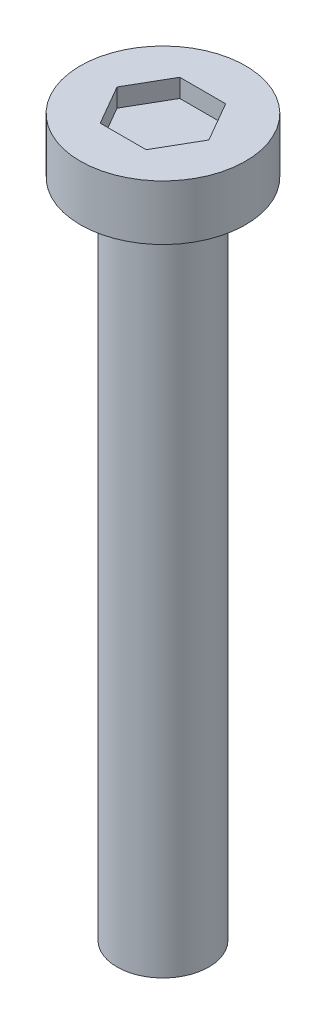
ISO-10303-21;
HEADER;
FILE_DESCRIPTION(('STEP AP214'),'2;1');
FILE_NAME('part.step','',(''),(''),'','','');
FILE_SCHEMA(('AUTOMOTIVE_DESIGN { 1 0 10303 214 1 1 1 1 }'));
ENDSEC;
DATA;
#1=APPLICATION_CONTEXT('core data for automotive mechanical design processes');
#2=APPLICATION_PROTOCOL_DEFINITION('international standard','automotive_design',2000,#1);
#3=PRODUCT_CONTEXT('',#1,'mechanical');
#4=PRODUCT('Part','Part','',(#3));
#5=PRODUCT_RELATED_PRODUCT_CATEGORY('part','',(#4));
#6=PRODUCT_DEFINITION_FORMATION('','',#4);
#7=PRODUCT_DEFINITION_CONTEXT('part definition',#1,'design');
#8=PRODUCT_DEFINITION('design','',#6,#7);
#9=PRODUCT_DEFINITION_SHAPE('','',#8);
#10=(LENGTH_UNIT() NAMED_UNIT(*) SI_UNIT(.MILLI.,.METRE.));
#11=(NAMED_UNIT(*) PLANE_ANGLE_UNIT() SI_UNIT($,.RADIAN.));
#12=(NAMED_UNIT(*) SI_UNIT($,.STERADIAN.) SOLID_ANGLE_UNIT());
#13=UNCERTAINTY_MEASURE_WITH_UNIT(LENGTH_MEASURE(1.E-05),#10,'distance_accuracy_value','');
#14=(GEOMETRIC_REPRESENTATION_CONTEXT(3) GLOBAL_UNCERTAINTY_ASSIGNED_CONTEXT((#13)) GLOBAL_UNIT_ASSIGNED_CONTEXT((#10,
#11,#12)) REPRESENTATION_CONTEXT('',''));
#15=CARTESIAN_POINT('',(0.,0.,0.));
#16=DIRECTION('',(0.,0.,1.));
#17=DIRECTION('',(1.,0.,0.));
#18=AXIS2_PLACEMENT_3D('',#15,#16,#17);
#19=CARTESIAN_POINT('',(0.,18.,0.));
#20=DIRECTION('',(0.,-1.,0.));
#21=DIRECTION('',(0.,0.,-1.));
#22=AXIS2_PLACEMENT_3D('',#19,#20,#21);
#23=CYLINDRICAL_SURFACE('',#22,1.25);
#24=CARTESIAN_POINT('',(0.,18.,0.));
#25=DIRECTION('',(0.,1.,0.));
#26=DIRECTION('',(0.,0.,1.));
#27=AXIS2_PLACEMENT_3D('',#24,#25,#26);
#28=CIRCLE('',#27,1.25);
#29=CARTESIAN_POINT('',(0.,18.,1.25));
#30=VERTEX_POINT('',#29);
#31=EDGE_CURVE('E11',#30,#30,#28,.T.);
#32=ORIENTED_EDGE('',*,*,#31,.F.);
#33=EDGE_LOOP('',(#32));
#34=FACE_BOUND('',#33,.T.);
#35=CARTESIAN_POINT('',(0.,0.,0.));
#36=DIRECTION('',(0.,1.,0.));
#37=DIRECTION('',(0.,0.,1.));
#38=AXIS2_PLACEMENT_3D('',#35,#36,#37);
#39=CIRCLE('',#38,1.25);
#40=CARTESIAN_POINT('',(0.,0.,1.25));
#41=VERTEX_POINT('',#40);
#42=EDGE_CURVE('E42',#41,#41,#39,.T.);
#43=ORIENTED_EDGE('',*,*,#42,.T.);
#44=EDGE_LOOP('',(#43));
#45=FACE_BOUND('',#44,.T.);
#46=ADVANCED_FACE('F39',(#34,#45),#23,.T.);
#47=CARTESIAN_POINT('',(0.,0.,0.));
#48=DIRECTION('',(0.,1.,0.));
#49=DIRECTION('',(0.,0.,1.));
#50=AXIS2_PLACEMENT_3D('',#47,#48,#49);
#51=PLANE('',#50);
#52=ORIENTED_EDGE('',*,*,#42,.F.);
#53=EDGE_LOOP('',(#52));
#54=FACE_BOUND('',#53,.T.);
#55=ADVANCED_FACE('F189',(#54),#51,.F.);
#56=CARTESIAN_POINT('',(0.,19.5,0.));
#57=DIRECTION('',(0.,-1.,0.));
#58=DIRECTION('',(0.,0.,-1.));
#59=AXIS2_PLACEMENT_3D('',#56,#57,#58);
#60=CYLINDRICAL_SURFACE('',#59,2.25);
#61=CARTESIAN_POINT('',(0.,19.5,0.));
#62=DIRECTION('',(0.,1.,0.));
#63=DIRECTION('',(0.,0.,1.));
#64=AXIS2_PLACEMENT_3D('',#61,#62,#63);
#65=CIRCLE('',#64,2.25);
#66=CARTESIAN_POINT('',(0.,19.5,2.25));
#67=VERTEX_POINT('',#66);
#68=EDGE_CURVE('E163',#67,#67,#65,.T.);
#69=ORIENTED_EDGE('',*,*,#68,.F.);
#70=EDGE_LOOP('',(#69));
#71=FACE_BOUND('',#70,.T.);
#72=CARTESIAN_POINT('',(0.,18.,0.));
#73=DIRECTION('',(0.,1.,0.));
#74=DIRECTION('',(0.,0.,1.));
#75=AXIS2_PLACEMENT_3D('',#72,#73,#74);
#76=CIRCLE('',#75,2.25);
#77=CARTESIAN_POINT('',(0.,18.,2.25));
#78=VERTEX_POINT('',#77);
#79=EDGE_CURVE('E153',#78,#78,#76,.T.);
#80=ORIENTED_EDGE('',*,*,#79,.T.);
#81=EDGE_LOOP('',(#80));
#82=FACE_BOUND('',#81,.T.);
#83=ADVANCED_FACE('F171',(#71,#82),#60,.T.);
#84=CARTESIAN_POINT('',(0.,19.5,0.));
#85=DIRECTION('',(0.,1.,0.));
#86=DIRECTION('',(0.,0.,1.));
#87=AXIS2_PLACEMENT_3D('',#84,#85,#86);
#88=PLANE('',#87);
#89=DIRECTION('',(0.5,0.,-0.866025403784439));
#90=VECTOR('',#89,1.);
#91=CARTESIAN_POINT('',(0.625,19.5,1.08253175473055));
#92=LINE('',#91,#90);
#93=CARTESIAN_POINT('',(0.625,19.5,1.08253175473055));
#94=VERTEX_POINT('',#93);
#95=CARTESIAN_POINT('',(1.25,19.5,0.));
#96=VERTEX_POINT('',#95);
#97=EDGE_CURVE('E54',#94,#96,#92,.T.);
#98=ORIENTED_EDGE('',*,*,#97,.F.);
#99=DIRECTION('',(1.,0.,0.));
#100=VECTOR('',#99,1.);
#101=CARTESIAN_POINT('',(-0.625,19.5,1.08253175473055));
#102=LINE('',#101,#100);
#103=CARTESIAN_POINT('',(-0.625,19.5,1.08253175473055));
#104=VERTEX_POINT('',#103);
#105=EDGE_CURVE('E147',#104,#94,#102,.T.);
#106=ORIENTED_EDGE('',*,*,#105,.F.);
#107=DIRECTION('',(0.5,0.,0.866025403784439));
#108=VECTOR('',#107,1.);
#109=CARTESIAN_POINT('',(-1.25,19.5,0.));
#110=LINE('',#109,#108);
#111=CARTESIAN_POINT('',(-1.25,19.5,0.));
#112=VERTEX_POINT('',#111);
#113=EDGE_CURVE('E144',#112,#104,#110,.T.);
#114=ORIENTED_EDGE('',*,*,#113,.F.);
#115=DIRECTION('',(-0.5,0.,0.866025403784439));
#116=VECTOR('',#115,1.);
#117=CARTESIAN_POINT('',(-0.625,19.5,-1.08253175473055));
#118=LINE('',#117,#116);
#119=CARTESIAN_POINT('',(-0.625,19.5,-1.08253175473055));
#120=VERTEX_POINT('',#119);
#121=EDGE_CURVE('E102',#120,#112,#118,.T.);
#122=ORIENTED_EDGE('',*,*,#121,.F.);
#123=DIRECTION('',(-1.,0.,0.));
#124=VECTOR('',#123,1.);
#125=CARTESIAN_POINT('',(0.625,19.5,-1.08253175473055));
#126=LINE('',#125,#124);
#127=CARTESIAN_POINT('',(0.625,19.5,-1.08253175473055));
#128=VERTEX_POINT('',#127);
#129=EDGE_CURVE('E138',#128,#120,#126,.T.);
#130=ORIENTED_EDGE('',*,*,#129,.F.);
#131=DIRECTION('',(-0.5,0.,-0.866025403784439));
#132=VECTOR('',#131,1.);
#133=CARTESIAN_POINT('',(1.25,19.5,0.));
#134=LINE('',#133,#132);
#135=EDGE_CURVE('E134',#96,#128,#134,.T.);
#136=ORIENTED_EDGE('',*,*,#135,.F.);
#137=EDGE_LOOP('',(#98,#106,#114,#122,#130,#136));
#138=FACE_BOUND('',#137,.T.);
#139=ORIENTED_EDGE('',*,*,#68,.T.);
#140=EDGE_LOOP('',(#139));
#141=FACE_BOUND('',#140,.T.);
#142=ADVANCED_FACE('F176',(#138,#141),#88,.T.);
#143=CARTESIAN_POINT('',(0.,18.,0.));
#144=DIRECTION('',(0.,1.,0.));
#145=DIRECTION('',(0.,0.,1.));
#146=AXIS2_PLACEMENT_3D('',#143,#144,#145);
#147=PLANE('',#146);
#148=ORIENTED_EDGE('',*,*,#31,.T.);
#149=EDGE_LOOP('',(#148));
#150=FACE_BOUND('',#149,.T.);
#151=ORIENTED_EDGE('',*,*,#79,.F.);
#152=EDGE_LOOP('',(#151));
#153=FACE_BOUND('',#152,.T.);
#154=ADVANCED_FACE('F173',(#150,#153),#147,.F.);
#155=CARTESIAN_POINT('',(0.625,19.,1.08253175473055));
#156=DIRECTION('',(0.866025403784439,0.,0.5));
#157=DIRECTION('',(0.5,0.,-0.866025403784439));
#158=AXIS2_PLACEMENT_3D('',#155,#156,#157);
#159=PLANE('',#158);
#160=ORIENTED_EDGE('',*,*,#97,.T.);
#161=DIRECTION('',(0.,1.,0.));
#162=VECTOR('',#161,1.);
#163=CARTESIAN_POINT('',(1.25,19.,0.));
#164=LINE('',#163,#162);
#165=CARTESIAN_POINT('',(1.25,19.,0.));
#166=VERTEX_POINT('',#165);
#167=EDGE_CURVE('E84',#166,#96,#164,.T.);
#168=ORIENTED_EDGE('',*,*,#167,.F.);
#169=DIRECTION('',(0.5,0.,-0.866025403784439));
#170=VECTOR('',#169,1.);
#171=CARTESIAN_POINT('',(0.625,19.,1.08253175473055));
#172=LINE('',#171,#170);
#173=CARTESIAN_POINT('',(0.625,19.,1.08253175473055));
#174=VERTEX_POINT('',#173);
#175=EDGE_CURVE('E150',#174,#166,#172,.T.);
#176=ORIENTED_EDGE('',*,*,#175,.F.);
#177=DIRECTION('',(0.,1.,0.));
#178=VECTOR('',#177,1.);
#179=CARTESIAN_POINT('',(0.625,19.,1.08253175473055));
#180=LINE('',#179,#178);
#181=EDGE_CURVE('E62',#174,#94,#180,.T.);
#182=ORIENTED_EDGE('',*,*,#181,.T.);
#183=EDGE_LOOP('',(#160,#168,#176,#182));
#184=FACE_BOUND('',#183,.T.);
#185=ADVANCED_FACE('F175',(#184),#159,.F.);
#186=CARTESIAN_POINT('',(-0.625,19.,1.08253175473055));
#187=DIRECTION('',(0.,0.,1.));
#188=DIRECTION('',(1.,0.,0.));
#189=AXIS2_PLACEMENT_3D('',#186,#187,#188);
#190=PLANE('',#189);
#191=ORIENTED_EDGE('',*,*,#105,.T.);
#192=ORIENTED_EDGE('',*,*,#181,.F.);
#193=DIRECTION('',(1.,0.,0.));
#194=VECTOR('',#193,1.);
#195=CARTESIAN_POINT('',(-0.625,19.,1.08253175473055));
#196=LINE('',#195,#194);
#197=CARTESIAN_POINT('',(-0.625,19.,1.08253175473055));
#198=VERTEX_POINT('',#197);
#199=EDGE_CURVE('E116',#198,#174,#196,.T.);
#200=ORIENTED_EDGE('',*,*,#199,.F.);
#201=DIRECTION('',(0.,1.,0.));
#202=VECTOR('',#201,1.);
#203=CARTESIAN_POINT('',(-0.625,19.,1.08253175473055));
#204=LINE('',#203,#202);
#205=EDGE_CURVE('E107',#198,#104,#204,.T.);
#206=ORIENTED_EDGE('',*,*,#205,.T.);
#207=EDGE_LOOP('',(#191,#192,#200,#206));
#208=FACE_BOUND('',#207,.T.);
#209=ADVANCED_FACE('F183',(#208),#190,.F.);
#210=CARTESIAN_POINT('',(-1.25,19.,0.));
#211=DIRECTION('',(-0.866025403784439,0.,0.5));
#212=DIRECTION('',(0.5,0.,0.866025403784439));
#213=AXIS2_PLACEMENT_3D('',#210,#211,#212);
#214=PLANE('',#213);
#215=ORIENTED_EDGE('',*,*,#113,.T.);
#216=ORIENTED_EDGE('',*,*,#205,.F.);
#217=DIRECTION('',(0.5,0.,0.866025403784439));
#218=VECTOR('',#217,1.);
#219=CARTESIAN_POINT('',(-1.25,19.,0.));
#220=LINE('',#219,#218);
#221=CARTESIAN_POINT('',(-1.25,19.,0.));
#222=VERTEX_POINT('',#221);
#223=EDGE_CURVE('E111',#222,#198,#220,.T.);
#224=ORIENTED_EDGE('',*,*,#223,.F.);
#225=DIRECTION('',(0.,1.,0.));
#226=VECTOR('',#225,1.);
#227=CARTESIAN_POINT('',(-1.25,19.,0.));
#228=LINE('',#227,#226);
#229=EDGE_CURVE('E95',#222,#112,#228,.T.);
#230=ORIENTED_EDGE('',*,*,#229,.T.);
#231=EDGE_LOOP('',(#215,#216,#224,#230));
#232=FACE_BOUND('',#231,.T.);
#233=ADVANCED_FACE('F112',(#232),#214,.F.);
#234=CARTESIAN_POINT('',(-0.625,19.,-1.08253175473055));
#235=DIRECTION('',(-0.866025403784439,0.,-0.5));
#236=DIRECTION('',(-0.5,0.,0.866025403784439));
#237=AXIS2_PLACEMENT_3D('',#234,#235,#236);
#238=PLANE('',#237);
#239=ORIENTED_EDGE('',*,*,#121,.T.);
#240=ORIENTED_EDGE('',*,*,#229,.F.);
#241=DIRECTION('',(-0.5,0.,0.866025403784439));
#242=VECTOR('',#241,1.);
#243=CARTESIAN_POINT('',(-0.625,19.,-1.08253175473055));
#244=LINE('',#243,#242);
#245=CARTESIAN_POINT('',(-0.625,19.,-1.08253175473055));
#246=VERTEX_POINT('',#245);
#247=EDGE_CURVE('E99',#246,#222,#244,.T.);
#248=ORIENTED_EDGE('',*,*,#247,.F.);
#249=DIRECTION('',(0.,1.,0.));
#250=VECTOR('',#249,1.);
#251=CARTESIAN_POINT('',(-0.625,19.,-1.08253175473055));
#252=LINE('',#251,#250);
#253=EDGE_CURVE('E108',#246,#120,#252,.T.);
#254=ORIENTED_EDGE('',*,*,#253,.T.);
#255=EDGE_LOOP('',(#239,#240,#248,#254));
#256=FACE_BOUND('',#255,.T.);
#257=ADVANCED_FACE('F97',(#256),#238,.F.);
#258=CARTESIAN_POINT('',(0.625,19.,-1.08253175473055));
#259=DIRECTION('',(0.,0.,-1.));
#260=DIRECTION('',(-1.,0.,0.));
#261=AXIS2_PLACEMENT_3D('',#258,#259,#260);
#262=PLANE('',#261);
#263=ORIENTED_EDGE('',*,*,#129,.T.);
#264=ORIENTED_EDGE('',*,*,#253,.F.);
#265=DIRECTION('',(-1.,0.,0.));
#266=VECTOR('',#265,1.);
#267=CARTESIAN_POINT('',(0.625,19.,-1.08253175473055));
#268=LINE('',#267,#266);
#269=CARTESIAN_POINT('',(0.625,19.,-1.08253175473055));
#270=VERTEX_POINT('',#269);
#271=EDGE_CURVE('E122',#270,#246,#268,.T.);
#272=ORIENTED_EDGE('',*,*,#271,.F.);
#273=DIRECTION('',(0.,1.,0.));
#274=VECTOR('',#273,1.);
#275=CARTESIAN_POINT('',(0.625,19.,-1.08253175473055));
#276=LINE('',#275,#274);
#277=EDGE_CURVE('E158',#270,#128,#276,.T.);
#278=ORIENTED_EDGE('',*,*,#277,.T.);
#279=EDGE_LOOP('',(#263,#264,#272,#278));
#280=FACE_BOUND('',#279,.T.);
#281=ADVANCED_FACE('F245',(#280),#262,.F.);
#282=CARTESIAN_POINT('',(1.25,19.,0.));
#283=DIRECTION('',(0.866025403784439,0.,-0.5));
#284=DIRECTION('',(-0.5,0.,-0.866025403784439));
#285=AXIS2_PLACEMENT_3D('',#282,#283,#284);
#286=PLANE('',#285);
#287=ORIENTED_EDGE('',*,*,#135,.T.);
#288=ORIENTED_EDGE('',*,*,#277,.F.);
#289=DIRECTION('',(-0.5,0.,-0.866025403784439));
#290=VECTOR('',#289,1.);
#291=CARTESIAN_POINT('',(1.25,19.,0.));
#292=LINE('',#291,#290);
#293=EDGE_CURVE('E126',#166,#270,#292,.T.);
#294=ORIENTED_EDGE('',*,*,#293,.F.);
#295=ORIENTED_EDGE('',*,*,#167,.T.);
#296=EDGE_LOOP('',(#287,#288,#294,#295));
#297=FACE_BOUND('',#296,.T.);
#298=ADVANCED_FACE('F254',(#297),#286,.F.);
#299=CARTESIAN_POINT('',(0.,19.,0.));
#300=DIRECTION('',(0.,1.,0.));
#301=DIRECTION('',(0.,0.,1.));
#302=AXIS2_PLACEMENT_3D('',#299,#300,#301);
#303=PLANE('',#302);
#304=ORIENTED_EDGE('',*,*,#175,.T.);
#305=ORIENTED_EDGE('',*,*,#293,.T.);
#306=ORIENTED_EDGE('',*,*,#271,.T.);
#307=ORIENTED_EDGE('',*,*,#247,.T.);
#308=ORIENTED_EDGE('',*,*,#223,.T.);
#309=ORIENTED_EDGE('',*,*,#199,.T.);
#310=EDGE_LOOP('',(#304,#305,#306,#307,#308,#309));
#311=FACE_BOUND('',#310,.T.);
#312=ADVANCED_FACE('F119',(#311),#303,.T.);
#313=CLOSED_SHELL('',(#46,#55,#83,#142,#154,#185,#209,#233,#257,#281,#298,#312));
#314=MANIFOLD_SOLID_BREP('B2',#313);
#315=ADVANCED_BREP_SHAPE_REPRESENTATION('',(#18,#314),#14);
#316=SHAPE_DEFINITION_REPRESENTATION(#9,#315);
ENDSEC;
END-ISO-10303-21;
